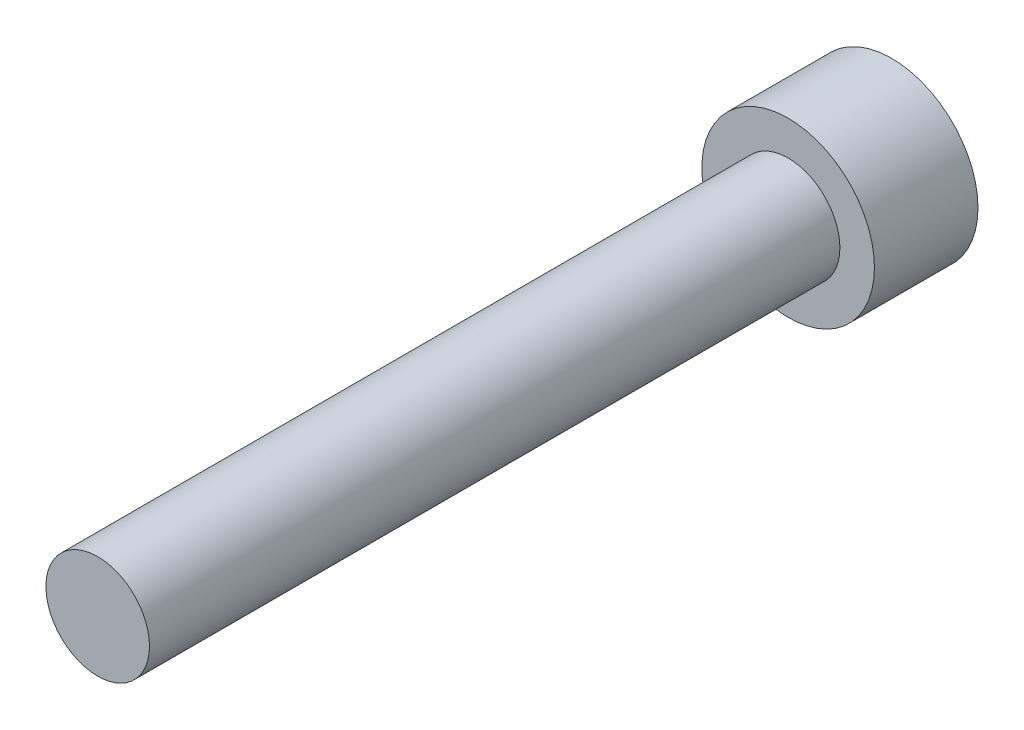
ISO-10303-21;
HEADER;
FILE_DESCRIPTION(('STEP AP214'),'2;1');
FILE_NAME('part.step','',(''),(''),'','','');
FILE_SCHEMA(('AUTOMOTIVE_DESIGN { 1 0 10303 214 1 1 1 1 }'));
ENDSEC;
DATA;
#1=APPLICATION_CONTEXT('core data for automotive mechanical design processes');
#2=APPLICATION_PROTOCOL_DEFINITION('international standard','automotive_design',2000,#1);
#3=PRODUCT_CONTEXT('',#1,'mechanical');
#4=PRODUCT('Part','Part','',(#3));
#5=PRODUCT_RELATED_PRODUCT_CATEGORY('part','',(#4));
#6=PRODUCT_DEFINITION_FORMATION('','',#4);
#7=PRODUCT_DEFINITION_CONTEXT('part definition',#1,'design');
#8=PRODUCT_DEFINITION('design','',#6,#7);
#9=PRODUCT_DEFINITION_SHAPE('','',#8);
#10=(LENGTH_UNIT() NAMED_UNIT(*) SI_UNIT(.MILLI.,.METRE.));
#11=(NAMED_UNIT(*) PLANE_ANGLE_UNIT() SI_UNIT($,.RADIAN.));
#12=(NAMED_UNIT(*) SI_UNIT($,.STERADIAN.) SOLID_ANGLE_UNIT());
#13=UNCERTAINTY_MEASURE_WITH_UNIT(LENGTH_MEASURE(1.E-05),#10,'distance_accuracy_value','');
#14=(GEOMETRIC_REPRESENTATION_CONTEXT(3) GLOBAL_UNCERTAINTY_ASSIGNED_CONTEXT((#13)) GLOBAL_UNIT_ASSIGNED_CONTEXT((#10,
#11,#12)) REPRESENTATION_CONTEXT('',''));
#15=CARTESIAN_POINT('',(0.,0.,0.));
#16=DIRECTION('',(0.,0.,1.));
#17=DIRECTION('',(1.,0.,0.));
#18=AXIS2_PLACEMENT_3D('',#15,#16,#17);
#19=CARTESIAN_POINT('',(0.,0.,-20.));
#20=DIRECTION('',(0.,0.,1.));
#21=DIRECTION('',(1.,0.,0.));
#22=AXIS2_PLACEMENT_3D('',#19,#20,#21);
#23=PLANE('',#22);
#24=CARTESIAN_POINT('',(0.,0.,-20.));
#25=DIRECTION('',(0.,0.,1.));
#26=DIRECTION('',(1.,0.,0.));
#27=AXIS2_PLACEMENT_3D('',#24,#25,#26);
#28=CIRCLE('',#27,1.5);
#29=CARTESIAN_POINT('',(1.5,0.,-20.));
#30=VERTEX_POINT('',#29);
#31=EDGE_CURVE('E10',#30,#30,#28,.T.);
#32=ORIENTED_EDGE('',*,*,#31,.F.);
#33=EDGE_LOOP('',(#32));
#34=FACE_BOUND('',#33,.T.);
#35=CARTESIAN_POINT('',(0.,0.,-20.));
#36=DIRECTION('',(0.,0.,1.));
#37=DIRECTION('',(1.,0.,0.));
#38=AXIS2_PLACEMENT_3D('',#35,#36,#37);
#39=CIRCLE('',#38,2.5);
#40=CARTESIAN_POINT('',(2.5,0.,-20.));
#41=VERTEX_POINT('',#40);
#42=EDGE_CURVE('E39',#41,#41,#39,.T.);
#43=ORIENTED_EDGE('',*,*,#42,.T.);
#44=EDGE_LOOP('',(#43));
#45=FACE_BOUND('',#44,.T.);
#46=ADVANCED_FACE('F31',(#34,#45),#23,.T.);
#47=CARTESIAN_POINT('',(0.,0.,0.));
#48=DIRECTION('',(0.,0.,1.));
#49=DIRECTION('',(1.,0.,0.));
#50=AXIS2_PLACEMENT_3D('',#47,#48,#49);
#51=CYLINDRICAL_SURFACE('',#50,2.5);
#52=CARTESIAN_POINT('',(0.,0.,-23.));
#53=DIRECTION('',(0.,0.,1.));
#54=DIRECTION('',(1.,0.,0.));
#55=AXIS2_PLACEMENT_3D('',#52,#53,#54);
#56=CIRCLE('',#55,2.5);
#57=CARTESIAN_POINT('',(2.5,0.,-23.));
#58=VERTEX_POINT('',#57);
#59=EDGE_CURVE('E43',#58,#58,#56,.T.);
#60=ORIENTED_EDGE('',*,*,#59,.T.);
#61=EDGE_LOOP('',(#60));
#62=FACE_BOUND('',#61,.T.);
#63=ORIENTED_EDGE('',*,*,#42,.F.);
#64=EDGE_LOOP('',(#63));
#65=FACE_BOUND('',#64,.T.);
#66=ADVANCED_FACE('F62',(#62,#65),#51,.T.);
#67=CARTESIAN_POINT('',(0.,0.,-23.));
#68=DIRECTION('',(0.,0.,1.));
#69=DIRECTION('',(1.,0.,0.));
#70=AXIS2_PLACEMENT_3D('',#67,#68,#69);
#71=PLANE('',#70);
#72=ORIENTED_EDGE('',*,*,#59,.F.);
#73=EDGE_LOOP('',(#72));
#74=FACE_BOUND('',#73,.T.);
#75=ADVANCED_FACE('F58',(#74),#71,.F.);
#76=CARTESIAN_POINT('',(0.,0.,0.));
#77=DIRECTION('',(0.,0.,1.));
#78=DIRECTION('',(1.,0.,0.));
#79=AXIS2_PLACEMENT_3D('',#76,#77,#78);
#80=PLANE('',#79);
#81=CARTESIAN_POINT('',(0.,0.,0.));
#82=DIRECTION('',(0.,0.,1.));
#83=DIRECTION('',(1.,0.,0.));
#84=AXIS2_PLACEMENT_3D('',#81,#82,#83);
#85=CIRCLE('',#84,1.5);
#86=CARTESIAN_POINT('',(1.5,0.,0.));
#87=VERTEX_POINT('',#86);
#88=EDGE_CURVE('E35',#87,#87,#85,.T.);
#89=ORIENTED_EDGE('',*,*,#88,.T.);
#90=EDGE_LOOP('',(#89));
#91=FACE_BOUND('',#90,.T.);
#92=ADVANCED_FACE('F52',(#91),#80,.T.);
#93=CARTESIAN_POINT('',(0.,0.,0.));
#94=DIRECTION('',(0.,0.,1.));
#95=DIRECTION('',(1.,0.,0.));
#96=AXIS2_PLACEMENT_3D('',#93,#94,#95);
#97=CYLINDRICAL_SURFACE('',#96,1.5);
#98=ORIENTED_EDGE('',*,*,#31,.T.);
#99=EDGE_LOOP('',(#98));
#100=FACE_BOUND('',#99,.T.);
#101=ORIENTED_EDGE('',*,*,#88,.F.);
#102=EDGE_LOOP('',(#101));
#103=FACE_BOUND('',#102,.T.);
#104=ADVANCED_FACE('F33',(#100,#103),#97,.T.);
#105=CLOSED_SHELL('',(#46,#66,#75,#92,#104));
#106=MANIFOLD_SOLID_BREP('B2',#105);
#107=ADVANCED_BREP_SHAPE_REPRESENTATION('',(#18,#106),#14);
#108=SHAPE_DEFINITION_REPRESENTATION(#9,#107);
ENDSEC;
END-ISO-10303-21;
